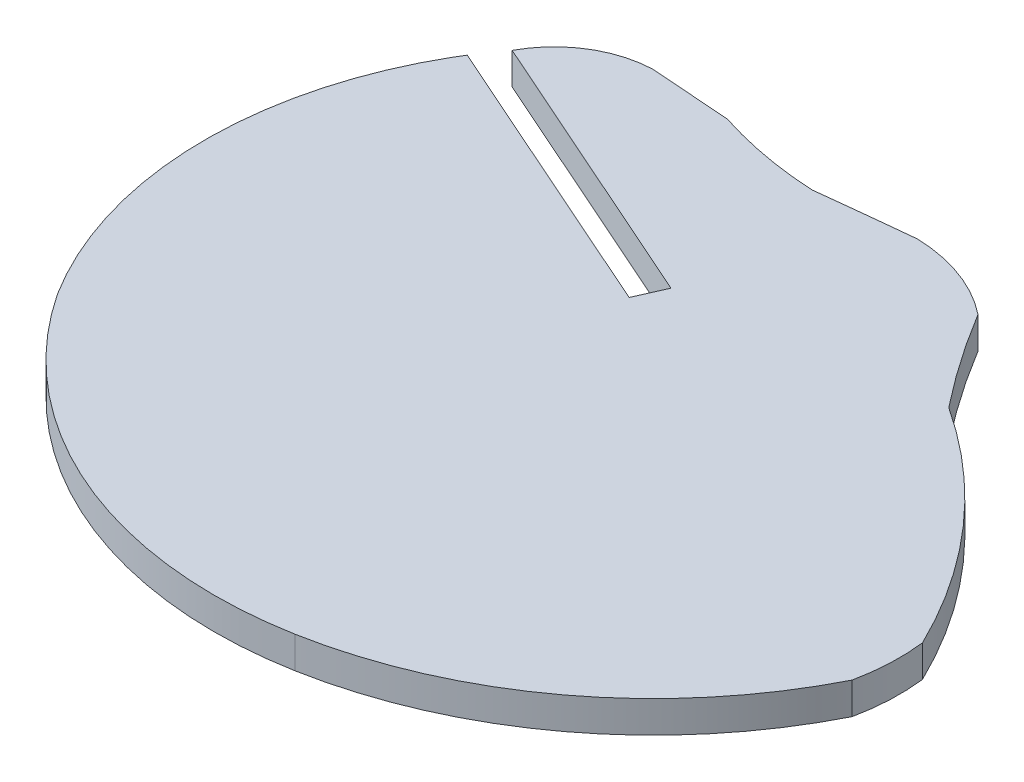
ISO-10303-21;
HEADER;
FILE_DESCRIPTION(('STEP AP214'),'2;1');
FILE_NAME('part.step','',(''),(''),'','','');
FILE_SCHEMA(('AUTOMOTIVE_DESIGN { 1 0 10303 214 1 1 1 1 }'));
ENDSEC;
DATA;
#1=APPLICATION_CONTEXT('core data for automotive mechanical design processes');
#2=APPLICATION_PROTOCOL_DEFINITION('international standard','automotive_design',2000,#1);
#3=PRODUCT_CONTEXT('',#1,'mechanical');
#4=PRODUCT('Part','Part','',(#3));
#5=PRODUCT_RELATED_PRODUCT_CATEGORY('part','',(#4));
#6=PRODUCT_DEFINITION_FORMATION('','',#4);
#7=PRODUCT_DEFINITION_CONTEXT('part definition',#1,'design');
#8=PRODUCT_DEFINITION('design','',#6,#7);
#9=PRODUCT_DEFINITION_SHAPE('','',#8);
#10=(LENGTH_UNIT() NAMED_UNIT(*) SI_UNIT(.MILLI.,.METRE.));
#11=(NAMED_UNIT(*) PLANE_ANGLE_UNIT() SI_UNIT($,.RADIAN.));
#12=(NAMED_UNIT(*) SI_UNIT($,.STERADIAN.) SOLID_ANGLE_UNIT());
#13=UNCERTAINTY_MEASURE_WITH_UNIT(LENGTH_MEASURE(1.E-05),#10,'distance_accuracy_value','');
#14=(GEOMETRIC_REPRESENTATION_CONTEXT(3) GLOBAL_UNCERTAINTY_ASSIGNED_CONTEXT((#13)) GLOBAL_UNIT_ASSIGNED_CONTEXT((#10,
#11,#12)) REPRESENTATION_CONTEXT('',''));
#15=CARTESIAN_POINT('',(0.,0.,0.));
#16=DIRECTION('',(0.,0.,1.));
#17=DIRECTION('',(1.,0.,0.));
#18=AXIS2_PLACEMENT_3D('',#15,#16,#17);
#19=CARTESIAN_POINT('',(-513.924622778693,2.,-736.48301959265));
#20=DIRECTION('',(-0.0724946092176144,0.,0.997368804221581));
#21=DIRECTION('',(0.997368804221581,0.,0.0724946092176144));
#22=AXIS2_PLACEMENT_3D('',#19,#20,#21);
#23=PLANE('',#22);
#24=DIRECTION('',(-0.99736880422158,0.,-0.0724946092176144));
#25=VECTOR('',#24,1.);
#26=CARTESIAN_POINT('',(-513.924622778693,0.,-736.48301959265));
#27=LINE('',#26,#25);
#28=CARTESIAN_POINT('',(-224.978470000066,0.,-715.480720000005));
#29=VERTEX_POINT('',#28);
#30=CARTESIAN_POINT('',(-230.062540000026,0.,-715.850259999975));
#31=VERTEX_POINT('',#30);
#32=EDGE_CURVE('E11',#29,#31,#27,.T.);
#33=ORIENTED_EDGE('',*,*,#32,.T.);
#34=DIRECTION('',(0.,-1.,0.));
#35=VECTOR('',#34,1.);
#36=CARTESIAN_POINT('',(-230.062540000026,2.,-715.850259999975));
#37=LINE('',#36,#35);
#38=CARTESIAN_POINT('',(-230.062540000026,2.,-715.850259999975));
#39=VERTEX_POINT('',#38);
#40=EDGE_CURVE('E307',#39,#31,#37,.T.);
#41=ORIENTED_EDGE('',*,*,#40,.F.);
#42=DIRECTION('',(-0.99736880422158,0.,-0.0724946092176144));
#43=VECTOR('',#42,1.);
#44=CARTESIAN_POINT('',(-513.924622778693,2.,-736.48301959265));
#45=LINE('',#44,#43);
#46=CARTESIAN_POINT('',(-224.978470000066,2.,-715.480720000005));
#47=VERTEX_POINT('',#46);
#48=EDGE_CURVE('E41',#47,#39,#45,.T.);
#49=ORIENTED_EDGE('',*,*,#48,.F.);
#50=DIRECTION('',(0.,-1.,0.));
#51=VECTOR('',#50,1.);
#52=CARTESIAN_POINT('',(-224.978470000066,2.,-715.480720000005));
#53=LINE('',#52,#51);
#54=EDGE_CURVE('E113',#47,#29,#53,.T.);
#55=ORIENTED_EDGE('',*,*,#54,.T.);
#56=EDGE_LOOP('',(#33,#41,#49,#55));
#57=FACE_BOUND('',#56,.T.);
#58=ADVANCED_FACE('F37',(#57),#23,.F.);
#59=CARTESIAN_POINT('',(-229.817609846928,2.,-709.412090095872));
#60=DIRECTION('',(0.,-1.,0.));
#61=DIRECTION('',(0.,0.,-1.));
#62=AXIS2_PLACEMENT_3D('',#59,#60,#61);
#63=CYLINDRICAL_SURFACE('',#62,6.44282721279998);
#64=CARTESIAN_POINT('',(-229.817609846928,0.,-709.412090095872));
#65=DIRECTION('',(0.,1.,0.));
#66=DIRECTION('',(0.,0.,1.));
#67=AXIS2_PLACEMENT_3D('',#64,#65,#66);
#68=CIRCLE('',#67,6.44282721279998);
#69=CARTESIAN_POINT('',(-235.502030000045,0.,-712.44480999999));
#70=VERTEX_POINT('',#69);
#71=EDGE_CURVE('E47',#31,#70,#68,.T.);
#72=ORIENTED_EDGE('',*,*,#71,.T.);
#73=DIRECTION('',(0.,-1.,0.));
#74=VECTOR('',#73,1.);
#75=CARTESIAN_POINT('',(-235.502030000045,2.,-712.44480999999));
#76=LINE('',#75,#74);
#77=CARTESIAN_POINT('',(-235.502030000045,2.,-712.44480999999));
#78=VERTEX_POINT('',#77);
#79=EDGE_CURVE('E156',#78,#70,#76,.T.);
#80=ORIENTED_EDGE('',*,*,#79,.F.);
#81=CARTESIAN_POINT('',(-229.817609846928,2.,-709.412090095872));
#82=DIRECTION('',(0.,1.,0.));
#83=DIRECTION('',(0.,0.,1.));
#84=AXIS2_PLACEMENT_3D('',#81,#82,#83);
#85=CIRCLE('',#84,6.44282721279998);
#86=EDGE_CURVE('E104',#39,#78,#85,.T.);
#87=ORIENTED_EDGE('',*,*,#86,.F.);
#88=ORIENTED_EDGE('',*,*,#40,.T.);
#89=EDGE_LOOP('',(#72,#80,#87,#88));
#90=FACE_BOUND('',#89,.T.);
#91=ADVANCED_FACE('F308',(#90),#63,.T.);
#92=CARTESIAN_POINT('',(-426.177855850075,2.,-796.987504933386));
#93=DIRECTION('',(0.405329123553616,0.,-0.914170827361745));
#94=DIRECTION('',(-0.914170827361745,0.,-0.405329123553616));
#95=AXIS2_PLACEMENT_3D('',#92,#93,#94);
#96=PLANE('',#95);
#97=DIRECTION('',(0.914170827361745,0.,0.405329123553616));
#98=VECTOR('',#97,1.);
#99=CARTESIAN_POINT('',(-426.177855850075,0.,-796.987504933386));
#100=LINE('',#99,#98);
#101=CARTESIAN_POINT('',(-217.511480000014,0.,-704.468079999969));
#102=VERTEX_POINT('',#101);
#103=EDGE_CURVE('E150',#70,#102,#100,.T.);
#104=ORIENTED_EDGE('',*,*,#103,.T.);
#105=DIRECTION('',(0.,-1.,0.));
#106=VECTOR('',#105,1.);
#107=CARTESIAN_POINT('',(-217.511480000014,2.,-704.468079999969));
#108=LINE('',#107,#106);
#109=CARTESIAN_POINT('',(-217.511480000014,2.,-704.468079999969));
#110=VERTEX_POINT('',#109);
#111=EDGE_CURVE('E154',#110,#102,#108,.T.);
#112=ORIENTED_EDGE('',*,*,#111,.F.);
#113=DIRECTION('',(0.914170827361745,0.,0.405329123553616));
#114=VECTOR('',#113,1.);
#115=CARTESIAN_POINT('',(-426.177855850075,2.,-796.987504933386));
#116=LINE('',#115,#114);
#117=EDGE_CURVE('E202',#78,#110,#116,.T.);
#118=ORIENTED_EDGE('',*,*,#117,.F.);
#119=ORIENTED_EDGE('',*,*,#79,.T.);
#120=EDGE_LOOP('',(#104,#112,#118,#119));
#121=FACE_BOUND('',#120,.T.);
#122=ADVANCED_FACE('F152',(#121),#96,.F.);
#123=CARTESIAN_POINT('',(-317.203686985334,2.,-479.625051209163));
#124=DIRECTION('',(0.91417036667382,0.,0.405330162577934));
#125=DIRECTION('',(0.405330162577934,0.,-0.91417036667382));
#126=AXIS2_PLACEMENT_3D('',#123,#124,#125);
#127=PLANE('',#126);
#128=DIRECTION('',(-0.405330162577934,0.,0.91417036667382));
#129=VECTOR('',#128,1.);
#130=CARTESIAN_POINT('',(-317.203686985334,0.,-479.625051209163));
#131=LINE('',#130,#129);
#132=CARTESIAN_POINT('',(-218.32214,0.,-702.63974));
#133=VERTEX_POINT('',#132);
#134=EDGE_CURVE('E158',#102,#133,#131,.T.);
#135=ORIENTED_EDGE('',*,*,#134,.T.);
#136=DIRECTION('',(0.,-1.,0.));
#137=VECTOR('',#136,1.);
#138=CARTESIAN_POINT('',(-218.32214,2.,-702.63974));
#139=LINE('',#138,#137);
#140=CARTESIAN_POINT('',(-218.32214,2.,-702.63974));
#141=VERTEX_POINT('',#140);
#142=EDGE_CURVE('E165',#141,#133,#139,.T.);
#143=ORIENTED_EDGE('',*,*,#142,.F.);
#144=DIRECTION('',(-0.405330162577934,0.,0.91417036667382));
#145=VECTOR('',#144,1.);
#146=CARTESIAN_POINT('',(-317.203686985334,2.,-479.625051209163));
#147=LINE('',#146,#145);
#148=EDGE_CURVE('E164',#110,#141,#147,.T.);
#149=ORIENTED_EDGE('',*,*,#148,.F.);
#150=ORIENTED_EDGE('',*,*,#111,.T.);
#151=EDGE_LOOP('',(#135,#143,#149,#150));
#152=FACE_BOUND('',#151,.T.);
#153=ADVANCED_FACE('F161',(#152),#127,.F.);
#154=CARTESIAN_POINT('',(-427.028190630829,2.,-795.145353467215));
#155=DIRECTION('',(-0.40521416279888,0.,0.914221790523067));
#156=DIRECTION('',(0.914221790523067,0.,0.40521416279888));
#157=AXIS2_PLACEMENT_3D('',#154,#155,#156);
#158=PLANE('',#157);
#159=DIRECTION('',(-0.914221790523067,0.,-0.40521416279888));
#160=VECTOR('',#159,1.);
#161=CARTESIAN_POINT('',(-427.028190630829,0.,-795.145353467215));
#162=LINE('',#161,#160);
#163=CARTESIAN_POINT('',(-236.6567,0.,-710.76624));
#164=VERTEX_POINT('',#163);
#165=EDGE_CURVE('E170',#133,#164,#162,.T.);
#166=ORIENTED_EDGE('',*,*,#165,.T.);
#167=DIRECTION('',(0.,-1.,0.));
#168=VECTOR('',#167,1.);
#169=CARTESIAN_POINT('',(-236.6567,2.,-710.76624));
#170=LINE('',#169,#168);
#171=CARTESIAN_POINT('',(-236.6567,2.,-710.76624));
#172=VERTEX_POINT('',#171);
#173=EDGE_CURVE('E240',#172,#164,#170,.T.);
#174=ORIENTED_EDGE('',*,*,#173,.F.);
#175=DIRECTION('',(-0.914221790523067,0.,-0.40521416279888));
#176=VECTOR('',#175,1.);
#177=CARTESIAN_POINT('',(-427.028190630829,2.,-795.145353467215));
#178=LINE('',#177,#176);
#179=EDGE_CURVE('E199',#141,#172,#178,.T.);
#180=ORIENTED_EDGE('',*,*,#179,.F.);
#181=ORIENTED_EDGE('',*,*,#142,.T.);
#182=EDGE_LOOP('',(#166,#174,#180,#181));
#183=FACE_BOUND('',#182,.T.);
#184=ADVANCED_FACE('F302',(#183),#158,.F.);
#185=CARTESIAN_POINT('',(-378.000111687945,2.,-481.129557560746));
#186=DIRECTION('',(0.851611087147484,0.,0.52417416594819));
#187=DIRECTION('',(0.52417416594819,0.,-0.851611087147484));
#188=AXIS2_PLACEMENT_3D('',#185,#186,#187);
#189=PLANE('',#188);
#190=DIRECTION('',(-0.52417416594819,0.,0.851611087147484));
#191=VECTOR('',#190,1.);
#192=CARTESIAN_POINT('',(-378.000111687945,0.,-481.129557560746));
#193=LINE('',#192,#191);
#194=CARTESIAN_POINT('',(-236.995869999959,0.,-710.215200000021));
#195=VERTEX_POINT('',#194);
#196=EDGE_CURVE('E172',#164,#195,#193,.T.);
#197=ORIENTED_EDGE('',*,*,#196,.T.);
#198=DIRECTION('',(0.,-1.,0.));
#199=VECTOR('',#198,1.);
#200=CARTESIAN_POINT('',(-236.995869999959,2.,-710.215200000021));
#201=LINE('',#200,#199);
#202=CARTESIAN_POINT('',(-236.995869999959,2.,-710.215200000021));
#203=VERTEX_POINT('',#202);
#204=EDGE_CURVE('E237',#203,#195,#201,.T.);
#205=ORIENTED_EDGE('',*,*,#204,.F.);
#206=DIRECTION('',(-0.52417416594819,0.,0.851611087147484));
#207=VECTOR('',#206,1.);
#208=CARTESIAN_POINT('',(-378.000111687945,2.,-481.129557560746));
#209=LINE('',#208,#207);
#210=EDGE_CURVE('E197',#172,#203,#209,.T.);
#211=ORIENTED_EDGE('',*,*,#210,.F.);
#212=ORIENTED_EDGE('',*,*,#173,.T.);
#213=EDGE_LOOP('',(#197,#205,#211,#212));
#214=FACE_BOUND('',#213,.T.);
#215=ADVANCED_FACE('F235',(#214),#189,.F.);
#216=CARTESIAN_POINT('',(-215.7028399609,2.,-697.8962978545));
#217=DIRECTION('',(0.,-1.,0.));
#218=DIRECTION('',(0.,0.,-1.));
#219=AXIS2_PLACEMENT_3D('',#216,#217,#218);
#220=CYLINDRICAL_SURFACE('',#219,24.5997658183);
#221=CARTESIAN_POINT('',(-215.7028399609,0.,-697.8962978545));
#222=DIRECTION('',(0.,1.,0.));
#223=DIRECTION('',(0.,0.,1.));
#224=AXIS2_PLACEMENT_3D('',#221,#222,#223);
#225=CIRCLE('',#224,24.5997658183);
#226=CARTESIAN_POINT('',(-236.533279999965,0.,-684.810380000023));
#227=VERTEX_POINT('',#226);
#228=EDGE_CURVE('E230',#195,#227,#225,.T.);
#229=ORIENTED_EDGE('',*,*,#228,.T.);
#230=DIRECTION('',(0.,-1.,0.));
#231=VECTOR('',#230,1.);
#232=CARTESIAN_POINT('',(-236.533279999965,2.,-684.810380000023));
#233=LINE('',#232,#231);
#234=CARTESIAN_POINT('',(-236.533279999965,2.,-684.810380000023));
#235=VERTEX_POINT('',#234);
#236=EDGE_CURVE('E246',#235,#227,#233,.T.);
#237=ORIENTED_EDGE('',*,*,#236,.F.);
#238=CARTESIAN_POINT('',(-215.7028399609,2.,-697.8962978545));
#239=DIRECTION('',(0.,1.,0.));
#240=DIRECTION('',(0.,0.,1.));
#241=AXIS2_PLACEMENT_3D('',#238,#239,#240);
#242=CIRCLE('',#241,24.5997658183);
#243=EDGE_CURVE('E195',#203,#235,#242,.T.);
#244=ORIENTED_EDGE('',*,*,#243,.F.);
#245=ORIENTED_EDGE('',*,*,#204,.T.);
#246=EDGE_LOOP('',(#229,#237,#244,#245));
#247=FACE_BOUND('',#246,.T.);
#248=ADVANCED_FACE('F243',(#247),#220,.T.);
#249=CARTESIAN_POINT('',(-215.111622495161,2.,-698.990881061107));
#250=DIRECTION('',(0.,-1.,0.));
#251=DIRECTION('',(0.,0.,-1.));
#252=AXIS2_PLACEMENT_3D('',#249,#250,#251);
#253=CYLINDRICAL_SURFACE('',#252,25.6899595289);
#254=CARTESIAN_POINT('',(-215.111622495161,0.,-698.990881061107));
#255=DIRECTION('',(0.,1.,0.));
#256=DIRECTION('',(0.,0.,1.));
#257=AXIS2_PLACEMENT_3D('',#254,#255,#256);
#258=CIRCLE('',#257,25.6899595289);
#259=CARTESIAN_POINT('',(-210.464730000031,0.,-673.724690000023));
#260=VERTEX_POINT('',#259);
#261=EDGE_CURVE('E228',#227,#260,#258,.T.);
#262=ORIENTED_EDGE('',*,*,#261,.T.);
#263=DIRECTION('',(0.,-1.,0.));
#264=VECTOR('',#263,1.);
#265=CARTESIAN_POINT('',(-210.464730000031,2.,-673.724690000023));
#266=LINE('',#265,#264);
#267=CARTESIAN_POINT('',(-210.464730000031,2.,-673.724690000023));
#268=VERTEX_POINT('',#267);
#269=EDGE_CURVE('E256',#268,#260,#266,.T.);
#270=ORIENTED_EDGE('',*,*,#269,.F.);
#271=CARTESIAN_POINT('',(-215.111622495161,2.,-698.990881061107));
#272=DIRECTION('',(0.,1.,0.));
#273=DIRECTION('',(0.,0.,1.));
#274=AXIS2_PLACEMENT_3D('',#271,#272,#273);
#275=CIRCLE('',#274,25.6899595289);
#276=EDGE_CURVE('E193',#235,#268,#275,.T.);
#277=ORIENTED_EDGE('',*,*,#276,.F.);
#278=ORIENTED_EDGE('',*,*,#236,.T.);
#279=EDGE_LOOP('',(#262,#270,#277,#278));
#280=FACE_BOUND('',#279,.T.);
#281=ADVANCED_FACE('F254',(#280),#253,.T.);
#282=CARTESIAN_POINT('',(-215.549266402914,2.,-701.388865193672));
#283=DIRECTION('',(0.,-1.,0.));
#284=DIRECTION('',(0.,0.,-1.));
#285=AXIS2_PLACEMENT_3D('',#282,#283,#284);
#286=CYLINDRICAL_SURFACE('',#285,28.1275505435);
#287=CARTESIAN_POINT('',(-215.549266402914,0.,-701.388865193672));
#288=DIRECTION('',(0.,1.,0.));
#289=DIRECTION('',(0.,0.,1.));
#290=AXIS2_PLACEMENT_3D('',#287,#288,#289);
#291=CIRCLE('',#290,28.1275505435);
#292=CARTESIAN_POINT('',(-190.404890000041,0.,-688.782540000033));
#293=VERTEX_POINT('',#292);
#294=EDGE_CURVE('E226',#260,#293,#291,.T.);
#295=ORIENTED_EDGE('',*,*,#294,.T.);
#296=DIRECTION('',(0.,-1.,0.));
#297=VECTOR('',#296,1.);
#298=CARTESIAN_POINT('',(-190.404890000041,2.,-688.782540000033));
#299=LINE('',#298,#297);
#300=CARTESIAN_POINT('',(-190.404890000041,2.,-688.782540000033));
#301=VERTEX_POINT('',#300);
#302=EDGE_CURVE('E262',#301,#293,#299,.T.);
#303=ORIENTED_EDGE('',*,*,#302,.F.);
#304=CARTESIAN_POINT('',(-215.549266402914,2.,-701.388865193672));
#305=DIRECTION('',(0.,1.,0.));
#306=DIRECTION('',(0.,0.,1.));
#307=AXIS2_PLACEMENT_3D('',#304,#305,#306);
#308=CIRCLE('',#307,28.1275505435);
#309=EDGE_CURVE('E191',#268,#301,#308,.T.);
#310=ORIENTED_EDGE('',*,*,#309,.F.);
#311=ORIENTED_EDGE('',*,*,#269,.T.);
#312=EDGE_LOOP('',(#295,#303,#310,#311));
#313=FACE_BOUND('',#312,.T.);
#314=ADVANCED_FACE('F259',(#313),#286,.T.);
#315=CARTESIAN_POINT('',(-203.237059414721,2.,-691.470133441979));
#316=DIRECTION('',(0.,-1.,0.));
#317=DIRECTION('',(0.,0.,-1.));
#318=AXIS2_PLACEMENT_3D('',#315,#316,#317);
#319=CYLINDRICAL_SURFACE('',#318,13.1105961114);
#320=CARTESIAN_POINT('',(-203.237059414721,0.,-691.470133441979));
#321=DIRECTION('',(0.,1.,0.));
#322=DIRECTION('',(0.,0.,1.));
#323=AXIS2_PLACEMENT_3D('',#320,#321,#322);
#324=CIRCLE('',#323,13.1105961114);
#325=CARTESIAN_POINT('',(-190.219849999992,0.,-693.032179999975));
#326=VERTEX_POINT('',#325);
#327=EDGE_CURVE('E224',#293,#326,#324,.T.);
#328=ORIENTED_EDGE('',*,*,#327,.T.);
#329=DIRECTION('',(0.,-1.,0.));
#330=VECTOR('',#329,1.);
#331=CARTESIAN_POINT('',(-190.219849999992,2.,-693.032179999975));
#332=LINE('',#331,#330);
#333=CARTESIAN_POINT('',(-190.219849999992,2.,-693.032179999975));
#334=VERTEX_POINT('',#333);
#335=EDGE_CURVE('E264',#334,#326,#332,.T.);
#336=ORIENTED_EDGE('',*,*,#335,.F.);
#337=CARTESIAN_POINT('',(-203.237059414721,2.,-691.470133441979));
#338=DIRECTION('',(0.,1.,0.));
#339=DIRECTION('',(0.,0.,1.));
#340=AXIS2_PLACEMENT_3D('',#337,#338,#339);
#341=CIRCLE('',#340,13.1105961114);
#342=EDGE_CURVE('E189',#301,#334,#341,.T.);
#343=ORIENTED_EDGE('',*,*,#342,.F.);
#344=ORIENTED_EDGE('',*,*,#302,.T.);
#345=EDGE_LOOP('',(#328,#336,#343,#344));
#346=FACE_BOUND('',#345,.T.);
#347=ADVANCED_FACE('F298',(#346),#319,.T.);
#348=CARTESIAN_POINT('',(-220.942418297957,2.,-678.146129440772));
#349=DIRECTION('',(0.,-1.,0.));
#350=DIRECTION('',(0.,0.,-1.));
#351=AXIS2_PLACEMENT_3D('',#348,#349,#350);
#352=CYLINDRICAL_SURFACE('',#351,34.1389909645);
#353=CARTESIAN_POINT('',(-220.942418297957,0.,-678.146129440772));
#354=DIRECTION('',(0.,1.,0.));
#355=DIRECTION('',(0.,0.,1.));
#356=AXIS2_PLACEMENT_3D('',#353,#354,#355);
#357=CIRCLE('',#356,34.1389909645);
#358=CARTESIAN_POINT('',(-202.237250000006,0.,-706.704619999966));
#359=VERTEX_POINT('',#358);
#360=EDGE_CURVE('E221',#326,#359,#357,.T.);
#361=ORIENTED_EDGE('',*,*,#360,.T.);
#362=DIRECTION('',(0.,-1.,0.));
#363=VECTOR('',#362,1.);
#364=CARTESIAN_POINT('',(-202.237250000006,2.,-706.704619999966));
#365=LINE('',#364,#363);
#366=CARTESIAN_POINT('',(-202.237250000006,2.,-706.704619999966));
#367=VERTEX_POINT('',#366);
#368=EDGE_CURVE('E270',#367,#359,#365,.T.);
#369=ORIENTED_EDGE('',*,*,#368,.F.);
#370=CARTESIAN_POINT('',(-220.942418297957,2.,-678.146129440772));
#371=DIRECTION('',(0.,1.,0.));
#372=DIRECTION('',(0.,0.,1.));
#373=AXIS2_PLACEMENT_3D('',#370,#371,#372);
#374=CIRCLE('',#373,34.1389909645);
#375=EDGE_CURVE('E187',#334,#367,#374,.T.);
#376=ORIENTED_EDGE('',*,*,#375,.F.);
#377=ORIENTED_EDGE('',*,*,#335,.T.);
#378=EDGE_LOOP('',(#361,#369,#376,#377));
#379=FACE_BOUND('',#378,.T.);
#380=ADVANCED_FACE('F295',(#379),#352,.T.);
#381=CARTESIAN_POINT('',(-157.501836224612,2.,-742.139074550291));
#382=DIRECTION('',(0.,-1.,0.));
#383=DIRECTION('',(0.,0.,-1.));
#384=AXIS2_PLACEMENT_3D('',#381,#382,#383);
#385=CYLINDRICAL_SURFACE('',#384,57.0688865752154);
#386=CARTESIAN_POINT('',(-157.501836224612,0.,-742.139074550291));
#387=DIRECTION('',(0.,1.,0.));
#388=DIRECTION('',(0.,0.,1.));
#389=AXIS2_PLACEMENT_3D('',#386,#387,#388);
#390=CIRCLE('',#389,57.0688865752154);
#391=CARTESIAN_POINT('',(-206.397250000019,0.,-712.709559999987));
#392=VERTEX_POINT('',#391);
#393=EDGE_CURVE('E218',#392,#359,#390,.T.);
#394=ORIENTED_EDGE('',*,*,#393,.F.);
#395=DIRECTION('',(0.,-1.,0.));
#396=VECTOR('',#395,1.);
#397=CARTESIAN_POINT('',(-206.397250000019,2.,-712.709559999987));
#398=LINE('',#397,#396);
#399=CARTESIAN_POINT('',(-206.397250000019,2.,-712.709559999987));
#400=VERTEX_POINT('',#399);
#401=EDGE_CURVE('E272',#400,#392,#398,.T.);
#402=ORIENTED_EDGE('',*,*,#401,.F.);
#403=CARTESIAN_POINT('',(-157.501836224612,2.,-742.139074550291));
#404=DIRECTION('',(0.,1.,0.));
#405=DIRECTION('',(0.,0.,1.));
#406=AXIS2_PLACEMENT_3D('',#403,#404,#405);
#407=CIRCLE('',#406,57.0688865752154);
#408=EDGE_CURVE('E184',#400,#367,#407,.T.);
#409=ORIENTED_EDGE('',*,*,#408,.T.);
#410=ORIENTED_EDGE('',*,*,#368,.T.);
#411=EDGE_LOOP('',(#394,#402,#409,#410));
#412=FACE_BOUND('',#411,.T.);
#413=ADVANCED_FACE('F289',(#412),#385,.F.);
#414=CARTESIAN_POINT('',(-212.767931613871,2.,-704.693696905981));
#415=DIRECTION('',(0.,-1.,0.));
#416=DIRECTION('',(0.,0.,-1.));
#417=AXIS2_PLACEMENT_3D('',#414,#415,#416);
#418=CYLINDRICAL_SURFACE('',#417,10.2391232713999);
#419=CARTESIAN_POINT('',(-212.767931613871,0.,-704.693696905981));
#420=DIRECTION('',(0.,1.,0.));
#421=DIRECTION('',(0.,0.,1.));
#422=AXIS2_PLACEMENT_3D('',#419,#420,#421);
#423=CIRCLE('',#422,10.2391232713999);
#424=CARTESIAN_POINT('',(-212.405960000013,0.,-714.926419999942));
#425=VERTEX_POINT('',#424);
#426=EDGE_CURVE('E212',#392,#425,#423,.T.);
#427=ORIENTED_EDGE('',*,*,#426,.T.);
#428=DIRECTION('',(0.,-1.,0.));
#429=VECTOR('',#428,1.);
#430=CARTESIAN_POINT('',(-212.405960000013,2.,-714.926419999942));
#431=LINE('',#430,#429);
#432=CARTESIAN_POINT('',(-212.405960000013,2.,-714.926419999942));
#433=VERTEX_POINT('',#432);
#434=EDGE_CURVE('E274',#433,#425,#431,.T.);
#435=ORIENTED_EDGE('',*,*,#434,.F.);
#436=CARTESIAN_POINT('',(-212.767931613871,2.,-704.693696905981));
#437=DIRECTION('',(0.,1.,0.));
#438=DIRECTION('',(0.,0.,1.));
#439=AXIS2_PLACEMENT_3D('',#436,#437,#438);
#440=CIRCLE('',#439,10.2391232713999);
#441=EDGE_CURVE('E182',#400,#433,#440,.T.);
#442=ORIENTED_EDGE('',*,*,#441,.F.);
#443=ORIENTED_EDGE('',*,*,#401,.T.);
#444=EDGE_LOOP('',(#427,#435,#442,#443));
#445=FACE_BOUND('',#444,.T.);
#446=ADVANCED_FACE('F336',(#445),#418,.T.);
#447=CARTESIAN_POINT('',(-173.432381670453,2.,-324.355426912187));
#448=DIRECTION('',(0.,-1.,0.));
#449=DIRECTION('',(0.,0.,-1.));
#450=AXIS2_PLACEMENT_3D('',#447,#448,#449);
#451=CYLINDRICAL_SURFACE('',#450,392.510688325);
#452=CARTESIAN_POINT('',(-173.432381670453,0.,-324.355426912187));
#453=DIRECTION('',(0.,1.,0.));
#454=DIRECTION('',(0.,0.,1.));
#455=AXIS2_PLACEMENT_3D('',#452,#453,#454);
#456=CIRCLE('',#455,392.510688325);
#457=CARTESIAN_POINT('',(-218.41465999996,0.,-714.280080000001));
#458=VERTEX_POINT('',#457);
#459=EDGE_CURVE('E207',#425,#458,#456,.T.);
#460=ORIENTED_EDGE('',*,*,#459,.T.);
#461=DIRECTION('',(0.,-1.,0.));
#462=VECTOR('',#461,1.);
#463=CARTESIAN_POINT('',(-218.41465999996,2.,-714.280080000001));
#464=LINE('',#463,#462);
#465=CARTESIAN_POINT('',(-218.41465999996,2.,-714.280080000001));
#466=VERTEX_POINT('',#465);
#467=EDGE_CURVE('E276',#466,#458,#464,.T.);
#468=ORIENTED_EDGE('',*,*,#467,.F.);
#469=CARTESIAN_POINT('',(-173.432381670453,2.,-324.355426912187));
#470=DIRECTION('',(0.,1.,0.));
#471=DIRECTION('',(0.,0.,1.));
#472=AXIS2_PLACEMENT_3D('',#469,#470,#471);
#473=CIRCLE('',#472,392.510688325);
#474=EDGE_CURVE('E180',#433,#466,#473,.T.);
#475=ORIENTED_EDGE('',*,*,#474,.F.);
#476=ORIENTED_EDGE('',*,*,#434,.T.);
#477=EDGE_LOOP('',(#460,#468,#475,#476));
#478=FACE_BOUND('',#477,.T.);
#479=ADVANCED_FACE('F282',(#478),#451,.T.);
#480=CARTESIAN_POINT('',(-217.139200930525,2.,-739.795171999379));
#481=DIRECTION('',(0.,-1.,0.));
#482=DIRECTION('',(0.,0.,-1.));
#483=AXIS2_PLACEMENT_3D('',#480,#481,#482);
#484=CYLINDRICAL_SURFACE('',#483,25.5469511992039);
#485=CARTESIAN_POINT('',(-217.139200930525,0.,-739.795171999379));
#486=DIRECTION('',(0.,1.,0.));
#487=DIRECTION('',(0.,0.,1.));
#488=AXIS2_PLACEMENT_3D('',#485,#486,#487);
#489=CIRCLE('',#488,25.5469511992039);
#490=EDGE_CURVE('E203',#29,#458,#489,.T.);
#491=ORIENTED_EDGE('',*,*,#490,.F.);
#492=ORIENTED_EDGE('',*,*,#54,.F.);
#493=CARTESIAN_POINT('',(-217.139200930525,2.,-739.795171999379));
#494=DIRECTION('',(0.,1.,0.));
#495=DIRECTION('',(0.,0.,1.));
#496=AXIS2_PLACEMENT_3D('',#493,#494,#495);
#497=CIRCLE('',#496,25.5469511992039);
#498=EDGE_CURVE('E177',#47,#466,#497,.T.);
#499=ORIENTED_EDGE('',*,*,#498,.T.);
#500=ORIENTED_EDGE('',*,*,#467,.T.);
#501=EDGE_LOOP('',(#491,#492,#499,#500));
#502=FACE_BOUND('',#501,.T.);
#503=ADVANCED_FACE('F279',(#502),#484,.F.);
#504=CARTESIAN_POINT('',(-525.869702128861,2.,-572.1446));
#505=DIRECTION('',(0.,1.,0.));
#506=DIRECTION('',(0.,0.,1.));
#507=AXIS2_PLACEMENT_3D('',#504,#505,#506);
#508=PLANE('',#507);
#509=ORIENTED_EDGE('',*,*,#48,.T.);
#510=ORIENTED_EDGE('',*,*,#86,.T.);
#511=ORIENTED_EDGE('',*,*,#117,.T.);
#512=ORIENTED_EDGE('',*,*,#148,.T.);
#513=ORIENTED_EDGE('',*,*,#179,.T.);
#514=ORIENTED_EDGE('',*,*,#210,.T.);
#515=ORIENTED_EDGE('',*,*,#243,.T.);
#516=ORIENTED_EDGE('',*,*,#276,.T.);
#517=ORIENTED_EDGE('',*,*,#309,.T.);
#518=ORIENTED_EDGE('',*,*,#342,.T.);
#519=ORIENTED_EDGE('',*,*,#375,.T.);
#520=ORIENTED_EDGE('',*,*,#408,.F.);
#521=ORIENTED_EDGE('',*,*,#441,.T.);
#522=ORIENTED_EDGE('',*,*,#474,.T.);
#523=ORIENTED_EDGE('',*,*,#498,.F.);
#524=EDGE_LOOP('',(#509,#510,#511,#512,#513,#514,#515,#516,#517,#518,#519,#520,#521,#522,#523));
#525=FACE_BOUND('',#524,.T.);
#526=ADVANCED_FACE('F39',(#525),#508,.T.);
#527=CARTESIAN_POINT('',(-525.869702128861,0.,-572.1446));
#528=DIRECTION('',(0.,1.,0.));
#529=DIRECTION('',(0.,0.,1.));
#530=AXIS2_PLACEMENT_3D('',#527,#528,#529);
#531=PLANE('',#530);
#532=ORIENTED_EDGE('',*,*,#32,.F.);
#533=ORIENTED_EDGE('',*,*,#490,.T.);
#534=ORIENTED_EDGE('',*,*,#459,.F.);
#535=ORIENTED_EDGE('',*,*,#426,.F.);
#536=ORIENTED_EDGE('',*,*,#393,.T.);
#537=ORIENTED_EDGE('',*,*,#360,.F.);
#538=ORIENTED_EDGE('',*,*,#327,.F.);
#539=ORIENTED_EDGE('',*,*,#294,.F.);
#540=ORIENTED_EDGE('',*,*,#261,.F.);
#541=ORIENTED_EDGE('',*,*,#228,.F.);
#542=ORIENTED_EDGE('',*,*,#196,.F.);
#543=ORIENTED_EDGE('',*,*,#165,.F.);
#544=ORIENTED_EDGE('',*,*,#134,.F.);
#545=ORIENTED_EDGE('',*,*,#103,.F.);
#546=ORIENTED_EDGE('',*,*,#71,.F.);
#547=EDGE_LOOP('',(#532,#533,#534,#535,#536,#537,#538,#539,#540,#541,#542,#543,#544,#545,#546));
#548=FACE_BOUND('',#547,.T.);
#549=ADVANCED_FACE('F168',(#548),#531,.F.);
#550=CLOSED_SHELL('',(#58,#91,#122,#153,#184,#215,#248,#281,#314,#347,#380,#413,#446,#479,#503,
#526,#549));
#551=MANIFOLD_SOLID_BREP('B2',#550);
#552=ADVANCED_BREP_SHAPE_REPRESENTATION('',(#18,#551),#14);
#553=SHAPE_DEFINITION_REPRESENTATION(#9,#552);
ENDSEC;
END-ISO-10303-21;
